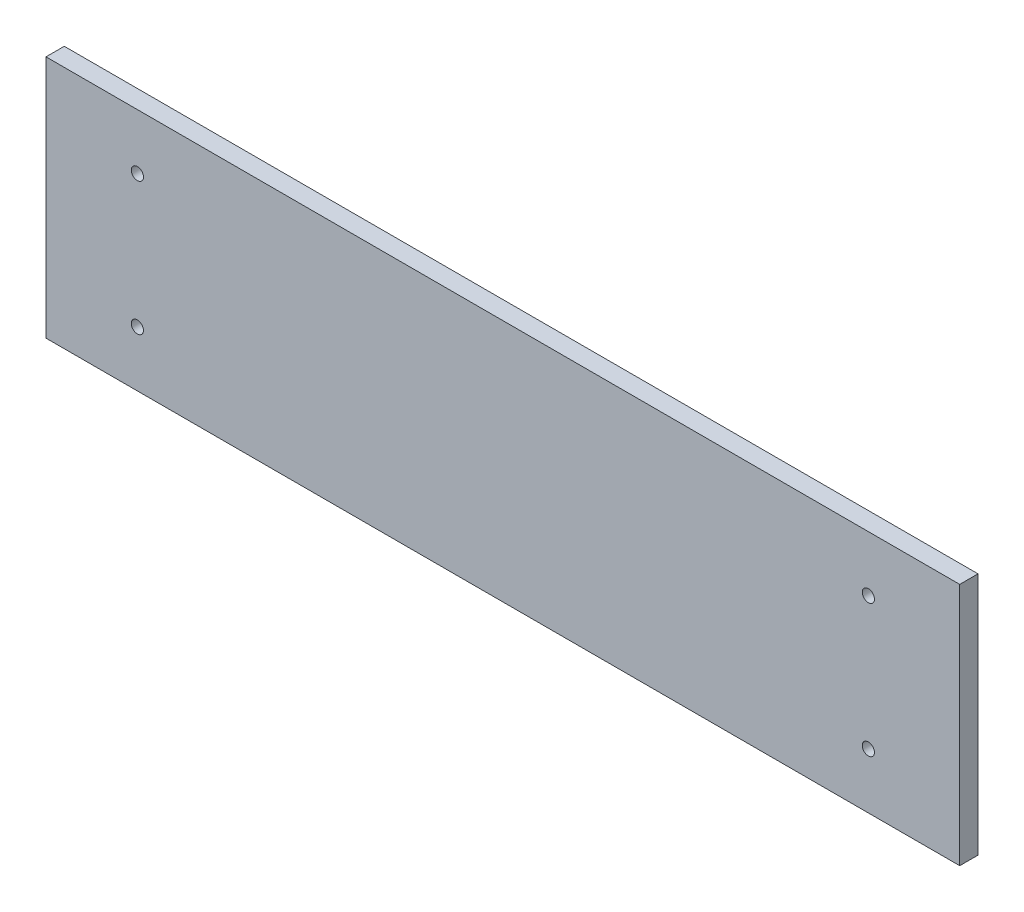
ISO-10303-21;
HEADER;
FILE_DESCRIPTION(('STEP AP214'),'2;1');
FILE_NAME('part.step','',(''),(''),'','','');
FILE_SCHEMA(('AUTOMOTIVE_DESIGN { 1 0 10303 214 1 1 1 1 }'));
ENDSEC;
DATA;
#1=APPLICATION_CONTEXT('core data for automotive mechanical design processes');
#2=APPLICATION_PROTOCOL_DEFINITION('international standard','automotive_design',2000,#1);
#3=PRODUCT_CONTEXT('',#1,'mechanical');
#4=PRODUCT('Part','Part','',(#3));
#5=PRODUCT_RELATED_PRODUCT_CATEGORY('part','',(#4));
#6=PRODUCT_DEFINITION_FORMATION('','',#4);
#7=PRODUCT_DEFINITION_CONTEXT('part definition',#1,'design');
#8=PRODUCT_DEFINITION('design','',#6,#7);
#9=PRODUCT_DEFINITION_SHAPE('','',#8);
#10=(LENGTH_UNIT() NAMED_UNIT(*) SI_UNIT(.MILLI.,.METRE.));
#11=(NAMED_UNIT(*) PLANE_ANGLE_UNIT() SI_UNIT($,.RADIAN.));
#12=(NAMED_UNIT(*) SI_UNIT($,.STERADIAN.) SOLID_ANGLE_UNIT());
#13=UNCERTAINTY_MEASURE_WITH_UNIT(LENGTH_MEASURE(1.E-05),#10,'distance_accuracy_value','');
#14=(GEOMETRIC_REPRESENTATION_CONTEXT(3) GLOBAL_UNCERTAINTY_ASSIGNED_CONTEXT((#13)) GLOBAL_UNIT_ASSIGNED_CONTEXT((#10,
#11,#12)) REPRESENTATION_CONTEXT('',''));
#15=CARTESIAN_POINT('',(0.,0.,0.));
#16=DIRECTION('',(0.,0.,1.));
#17=DIRECTION('',(1.,0.,0.));
#18=AXIS2_PLACEMENT_3D('',#15,#16,#17);
#19=CARTESIAN_POINT('',(-77.4869109947644,-14.2146596858639,3.));
#20=DIRECTION('',(1.,0.,0.));
#21=DIRECTION('',(0.,0.,-1.));
#22=AXIS2_PLACEMENT_3D('',#19,#20,#21);
#23=PLANE('',#22);
#24=DIRECTION('',(0.,-1.,0.));
#25=VECTOR('',#24,1.);
#26=CARTESIAN_POINT('',(-77.4869109947644,-14.2146596858639,0.));
#27=LINE('',#26,#25);
#28=CARTESIAN_POINT('',(-77.4869109947644,25.7853403141361,0.));
#29=VERTEX_POINT('',#28);
#30=CARTESIAN_POINT('',(-77.4869109947644,-14.2146596858639,0.));
#31=VERTEX_POINT('',#30);
#32=EDGE_CURVE('E107',#29,#31,#27,.T.);
#33=ORIENTED_EDGE('',*,*,#32,.T.);
#34=DIRECTION('',(0.,0.,-1.));
#35=VECTOR('',#34,1.);
#36=CARTESIAN_POINT('',(-77.4869109947644,-14.2146596858639,3.));
#37=LINE('',#36,#35);
#38=CARTESIAN_POINT('',(-77.4869109947644,-14.2146596858639,3.));
#39=VERTEX_POINT('',#38);
#40=EDGE_CURVE('E11',#39,#31,#37,.T.);
#41=ORIENTED_EDGE('',*,*,#40,.F.);
#42=DIRECTION('',(0.,-1.,0.));
#43=VECTOR('',#42,1.);
#44=CARTESIAN_POINT('',(-77.4869109947644,-14.2146596858639,3.));
#45=LINE('',#44,#43);
#46=CARTESIAN_POINT('',(-77.4869109947644,25.7853403141361,3.));
#47=VERTEX_POINT('',#46);
#48=EDGE_CURVE('E94',#47,#39,#45,.T.);
#49=ORIENTED_EDGE('',*,*,#48,.F.);
#50=DIRECTION('',(0.,0.,-1.));
#51=VECTOR('',#50,1.);
#52=CARTESIAN_POINT('',(-77.4869109947644,25.7853403141361,3.));
#53=LINE('',#52,#51);
#54=EDGE_CURVE('E103',#47,#29,#53,.T.);
#55=ORIENTED_EDGE('',*,*,#54,.T.);
#56=EDGE_LOOP('',(#33,#41,#49,#55));
#57=FACE_BOUND('',#56,.T.);
#58=ADVANCED_FACE('F41',(#57),#23,.F.);
#59=CARTESIAN_POINT('',(-77.4869109947644,-14.2146596858639,3.));
#60=DIRECTION('',(0.,1.,0.));
#61=DIRECTION('',(0.,0.,1.));
#62=AXIS2_PLACEMENT_3D('',#59,#60,#61);
#63=PLANE('',#62);
#64=DIRECTION('',(1.,0.,0.));
#65=VECTOR('',#64,1.);
#66=CARTESIAN_POINT('',(-77.4869109947644,-14.2146596858639,0.));
#67=LINE('',#66,#65);
#68=CARTESIAN_POINT('',(72.5130890052356,-14.2146596858639,0.));
#69=VERTEX_POINT('',#68);
#70=EDGE_CURVE('E98',#31,#69,#67,.T.);
#71=ORIENTED_EDGE('',*,*,#70,.T.);
#72=DIRECTION('',(0.,0.,-1.));
#73=VECTOR('',#72,1.);
#74=CARTESIAN_POINT('',(72.5130890052356,-14.2146596858639,3.));
#75=LINE('',#74,#73);
#76=CARTESIAN_POINT('',(72.5130890052356,-14.2146596858639,3.));
#77=VERTEX_POINT('',#76);
#78=EDGE_CURVE('E50',#77,#69,#75,.T.);
#79=ORIENTED_EDGE('',*,*,#78,.F.);
#80=DIRECTION('',(1.,0.,0.));
#81=VECTOR('',#80,1.);
#82=CARTESIAN_POINT('',(-77.4869109947644,-14.2146596858639,3.));
#83=LINE('',#82,#81);
#84=EDGE_CURVE('E89',#39,#77,#83,.T.);
#85=ORIENTED_EDGE('',*,*,#84,.F.);
#86=ORIENTED_EDGE('',*,*,#40,.T.);
#87=EDGE_LOOP('',(#71,#79,#85,#86));
#88=FACE_BOUND('',#87,.T.);
#89=ADVANCED_FACE('F97',(#88),#63,.F.);
#90=CARTESIAN_POINT('',(72.5130890052356,-14.2146596858639,3.));
#91=DIRECTION('',(-1.,0.,0.));
#92=DIRECTION('',(0.,0.,1.));
#93=AXIS2_PLACEMENT_3D('',#90,#91,#92);
#94=PLANE('',#93);
#95=DIRECTION('',(0.,1.,0.));
#96=VECTOR('',#95,1.);
#97=CARTESIAN_POINT('',(72.5130890052356,-14.2146596858639,0.));
#98=LINE('',#97,#96);
#99=CARTESIAN_POINT('',(72.5130890052356,25.7853403141361,0.));
#100=VERTEX_POINT('',#99);
#101=EDGE_CURVE('E76',#69,#100,#98,.T.);
#102=ORIENTED_EDGE('',*,*,#101,.T.);
#103=DIRECTION('',(0.,0.,-1.));
#104=VECTOR('',#103,1.);
#105=CARTESIAN_POINT('',(72.5130890052356,25.7853403141361,3.));
#106=LINE('',#105,#104);
#107=CARTESIAN_POINT('',(72.5130890052356,25.7853403141361,3.));
#108=VERTEX_POINT('',#107);
#109=EDGE_CURVE('E99',#108,#100,#106,.T.);
#110=ORIENTED_EDGE('',*,*,#109,.F.);
#111=DIRECTION('',(0.,1.,0.));
#112=VECTOR('',#111,1.);
#113=CARTESIAN_POINT('',(72.5130890052356,-14.2146596858639,3.));
#114=LINE('',#113,#112);
#115=EDGE_CURVE('E92',#77,#108,#114,.T.);
#116=ORIENTED_EDGE('',*,*,#115,.F.);
#117=ORIENTED_EDGE('',*,*,#78,.T.);
#118=EDGE_LOOP('',(#102,#110,#116,#117));
#119=FACE_BOUND('',#118,.T.);
#120=ADVANCED_FACE('F101',(#119),#94,.F.);
#121=CARTESIAN_POINT('',(-77.4869109947644,25.7853403141361,3.));
#122=DIRECTION('',(0.,-1.,0.));
#123=DIRECTION('',(0.,0.,-1.));
#124=AXIS2_PLACEMENT_3D('',#121,#122,#123);
#125=PLANE('',#124);
#126=DIRECTION('',(-1.,0.,0.));
#127=VECTOR('',#126,1.);
#128=CARTESIAN_POINT('',(-77.4869109947644,25.7853403141361,0.));
#129=LINE('',#128,#127);
#130=EDGE_CURVE('E82',#100,#29,#129,.T.);
#131=ORIENTED_EDGE('',*,*,#130,.T.);
#132=ORIENTED_EDGE('',*,*,#54,.F.);
#133=DIRECTION('',(-1.,0.,0.));
#134=VECTOR('',#133,1.);
#135=CARTESIAN_POINT('',(-77.4869109947644,25.7853403141361,3.));
#136=LINE('',#135,#134);
#137=EDGE_CURVE('E59',#108,#47,#136,.T.);
#138=ORIENTED_EDGE('',*,*,#137,.F.);
#139=ORIENTED_EDGE('',*,*,#109,.T.);
#140=EDGE_LOOP('',(#131,#132,#138,#139));
#141=FACE_BOUND('',#140,.T.);
#142=ADVANCED_FACE('F143',(#141),#125,.F.);
#143=CARTESIAN_POINT('',(0.,0.,3.));
#144=DIRECTION('',(0.,0.,-1.));
#145=DIRECTION('',(-1.,0.,0.));
#146=AXIS2_PLACEMENT_3D('',#143,#144,#145);
#147=PLANE('',#146);
#148=CARTESIAN_POINT('',(57.5130890052356,16.6853403141361,3.));
#149=DIRECTION('',(0.,0.,1.));
#150=DIRECTION('',(1.,0.,0.));
#151=AXIS2_PLACEMENT_3D('',#148,#149,#150);
#152=CIRCLE('',#151,0.999999999999998);
#153=CARTESIAN_POINT('',(58.5130890052356,16.6853403141361,3.));
#154=VERTEX_POINT('',#153);
#155=EDGE_CURVE('E226',#154,#154,#152,.T.);
#156=ORIENTED_EDGE('',*,*,#155,.F.);
#157=EDGE_LOOP('',(#156));
#158=FACE_BOUND('',#157,.T.);
#159=CARTESIAN_POINT('',(-62.4869109947644,16.6853403141361,3.));
#160=DIRECTION('',(0.,0.,1.));
#161=DIRECTION('',(1.,0.,0.));
#162=AXIS2_PLACEMENT_3D('',#159,#160,#161);
#163=CIRCLE('',#162,0.999999999999998);
#164=CARTESIAN_POINT('',(-61.4869109947644,16.6853403141361,3.));
#165=VERTEX_POINT('',#164);
#166=EDGE_CURVE('E223',#165,#165,#163,.T.);
#167=ORIENTED_EDGE('',*,*,#166,.F.);
#168=EDGE_LOOP('',(#167));
#169=FACE_BOUND('',#168,.T.);
#170=CARTESIAN_POINT('',(-62.4869109947644,-5.11465968586388,3.));
#171=DIRECTION('',(0.,0.,1.));
#172=DIRECTION('',(-1.,0.,0.));
#173=AXIS2_PLACEMENT_3D('',#170,#171,#172);
#174=CIRCLE('',#173,0.999999999999998);
#175=CARTESIAN_POINT('',(-63.4869109947644,-5.11465968586388,3.));
#176=VERTEX_POINT('',#175);
#177=EDGE_CURVE('E225',#176,#176,#174,.T.);
#178=ORIENTED_EDGE('',*,*,#177,.F.);
#179=EDGE_LOOP('',(#178));
#180=FACE_BOUND('',#179,.T.);
#181=CARTESIAN_POINT('',(57.5130890052356,-5.11465968586389,3.));
#182=DIRECTION('',(0.,0.,1.));
#183=DIRECTION('',(-1.,0.,0.));
#184=AXIS2_PLACEMENT_3D('',#181,#182,#183);
#185=CIRCLE('',#184,0.999999999999998);
#186=CARTESIAN_POINT('',(56.5130890052356,-5.11465968586389,3.));
#187=VERTEX_POINT('',#186);
#188=EDGE_CURVE('E119',#187,#187,#185,.T.);
#189=ORIENTED_EDGE('',*,*,#188,.F.);
#190=EDGE_LOOP('',(#189));
#191=FACE_BOUND('',#190,.T.);
#192=ORIENTED_EDGE('',*,*,#48,.T.);
#193=ORIENTED_EDGE('',*,*,#84,.T.);
#194=ORIENTED_EDGE('',*,*,#115,.T.);
#195=ORIENTED_EDGE('',*,*,#137,.T.);
#196=EDGE_LOOP('',(#192,#193,#194,#195));
#197=FACE_BOUND('',#196,.T.);
#198=ADVANCED_FACE('F90',(#158,#169,#180,#191,#197),#147,.F.);
#199=CARTESIAN_POINT('',(0.,0.,0.));
#200=DIRECTION('',(0.,0.,-1.));
#201=DIRECTION('',(-1.,0.,0.));
#202=AXIS2_PLACEMENT_3D('',#199,#200,#201);
#203=PLANE('',#202);
#204=CARTESIAN_POINT('',(57.5130890052356,16.6853403141361,0.));
#205=DIRECTION('',(0.,0.,-1.));
#206=DIRECTION('',(-1.,0.,0.));
#207=AXIS2_PLACEMENT_3D('',#204,#205,#206);
#208=CIRCLE('',#207,0.999999999999998);
#209=CARTESIAN_POINT('',(56.5130890052356,16.6853403141361,0.));
#210=VERTEX_POINT('',#209);
#211=EDGE_CURVE('E44',#210,#210,#208,.T.);
#212=ORIENTED_EDGE('',*,*,#211,.F.);
#213=EDGE_LOOP('',(#212));
#214=FACE_BOUND('',#213,.T.);
#215=CARTESIAN_POINT('',(-62.4869109947644,16.6853403141361,0.));
#216=DIRECTION('',(0.,0.,-1.));
#217=DIRECTION('',(-1.,0.,0.));
#218=AXIS2_PLACEMENT_3D('',#215,#216,#217);
#219=CIRCLE('',#218,0.999999999999998);
#220=CARTESIAN_POINT('',(-63.4869109947644,16.6853403141361,0.));
#221=VERTEX_POINT('',#220);
#222=EDGE_CURVE('E121',#221,#221,#219,.T.);
#223=ORIENTED_EDGE('',*,*,#222,.F.);
#224=EDGE_LOOP('',(#223));
#225=FACE_BOUND('',#224,.T.);
#226=CARTESIAN_POINT('',(-62.4869109947644,-5.11465968586388,0.));
#227=DIRECTION('',(0.,0.,-1.));
#228=DIRECTION('',(-1.,0.,0.));
#229=AXIS2_PLACEMENT_3D('',#226,#227,#228);
#230=CIRCLE('',#229,0.999999999999998);
#231=CARTESIAN_POINT('',(-63.4869109947644,-5.11465968586388,0.));
#232=VERTEX_POINT('',#231);
#233=EDGE_CURVE('E118',#232,#232,#230,.T.);
#234=ORIENTED_EDGE('',*,*,#233,.F.);
#235=EDGE_LOOP('',(#234));
#236=FACE_BOUND('',#235,.T.);
#237=CARTESIAN_POINT('',(57.5130890052356,-5.11465968586389,0.));
#238=DIRECTION('',(0.,0.,-1.));
#239=DIRECTION('',(-1.,0.,0.));
#240=AXIS2_PLACEMENT_3D('',#237,#238,#239);
#241=CIRCLE('',#240,0.999999999999998);
#242=CARTESIAN_POINT('',(56.5130890052356,-5.11465968586389,0.));
#243=VERTEX_POINT('',#242);
#244=EDGE_CURVE('E115',#243,#243,#241,.T.);
#245=ORIENTED_EDGE('',*,*,#244,.F.);
#246=EDGE_LOOP('',(#245));
#247=FACE_BOUND('',#246,.T.);
#248=ORIENTED_EDGE('',*,*,#32,.F.);
#249=ORIENTED_EDGE('',*,*,#130,.F.);
#250=ORIENTED_EDGE('',*,*,#101,.F.);
#251=ORIENTED_EDGE('',*,*,#70,.F.);
#252=EDGE_LOOP('',(#248,#249,#250,#251));
#253=FACE_BOUND('',#252,.T.);
#254=ADVANCED_FACE('F131',(#214,#225,#236,#247,#253),#203,.T.);
#255=CARTESIAN_POINT('',(57.5130890052356,-5.11465968586389,-7.));
#256=DIRECTION('',(0.,0.,1.));
#257=DIRECTION('',(1.,0.,0.));
#258=AXIS2_PLACEMENT_3D('',#255,#256,#257);
#259=CYLINDRICAL_SURFACE('',#258,0.999999999999998);
#260=ORIENTED_EDGE('',*,*,#244,.T.);
#261=EDGE_LOOP('',(#260));
#262=FACE_BOUND('',#261,.T.);
#263=ORIENTED_EDGE('',*,*,#188,.T.);
#264=EDGE_LOOP('',(#263));
#265=FACE_BOUND('',#264,.T.);
#266=ADVANCED_FACE('F134',(#262,#265),#259,.F.);
#267=CARTESIAN_POINT('',(-62.4869109947644,-5.11465968586388,-7.));
#268=DIRECTION('',(0.,0.,1.));
#269=DIRECTION('',(1.,0.,0.));
#270=AXIS2_PLACEMENT_3D('',#267,#268,#269);
#271=CYLINDRICAL_SURFACE('',#270,0.999999999999998);
#272=ORIENTED_EDGE('',*,*,#233,.T.);
#273=EDGE_LOOP('',(#272));
#274=FACE_BOUND('',#273,.T.);
#275=ORIENTED_EDGE('',*,*,#177,.T.);
#276=EDGE_LOOP('',(#275));
#277=FACE_BOUND('',#276,.T.);
#278=ADVANCED_FACE('F190',(#274,#277),#271,.F.);
#279=CARTESIAN_POINT('',(-62.4869109947644,16.6853403141361,-7.));
#280=DIRECTION('',(0.,0.,1.));
#281=DIRECTION('',(1.,0.,0.));
#282=AXIS2_PLACEMENT_3D('',#279,#280,#281);
#283=CYLINDRICAL_SURFACE('',#282,0.999999999999998);
#284=ORIENTED_EDGE('',*,*,#222,.T.);
#285=EDGE_LOOP('',(#284));
#286=FACE_BOUND('',#285,.T.);
#287=ORIENTED_EDGE('',*,*,#166,.T.);
#288=EDGE_LOOP('',(#287));
#289=FACE_BOUND('',#288,.T.);
#290=ADVANCED_FACE('F200',(#286,#289),#283,.F.);
#291=CARTESIAN_POINT('',(57.5130890052356,16.6853403141361,-7.));
#292=DIRECTION('',(0.,0.,1.));
#293=DIRECTION('',(1.,0.,0.));
#294=AXIS2_PLACEMENT_3D('',#291,#292,#293);
#295=CYLINDRICAL_SURFACE('',#294,0.999999999999998);
#296=ORIENTED_EDGE('',*,*,#211,.T.);
#297=EDGE_LOOP('',(#296));
#298=FACE_BOUND('',#297,.T.);
#299=ORIENTED_EDGE('',*,*,#155,.T.);
#300=EDGE_LOOP('',(#299));
#301=FACE_BOUND('',#300,.T.);
#302=ADVANCED_FACE('F128',(#298,#301),#295,.F.);
#303=CLOSED_SHELL('',(#58,#89,#120,#142,#198,#254,#266,#278,#290,#302));
#304=MANIFOLD_SOLID_BREP('B2',#303);
#305=ADVANCED_BREP_SHAPE_REPRESENTATION('',(#18,#304),#14);
#306=SHAPE_DEFINITION_REPRESENTATION(#9,#305);
ENDSEC;
END-ISO-10303-21;
